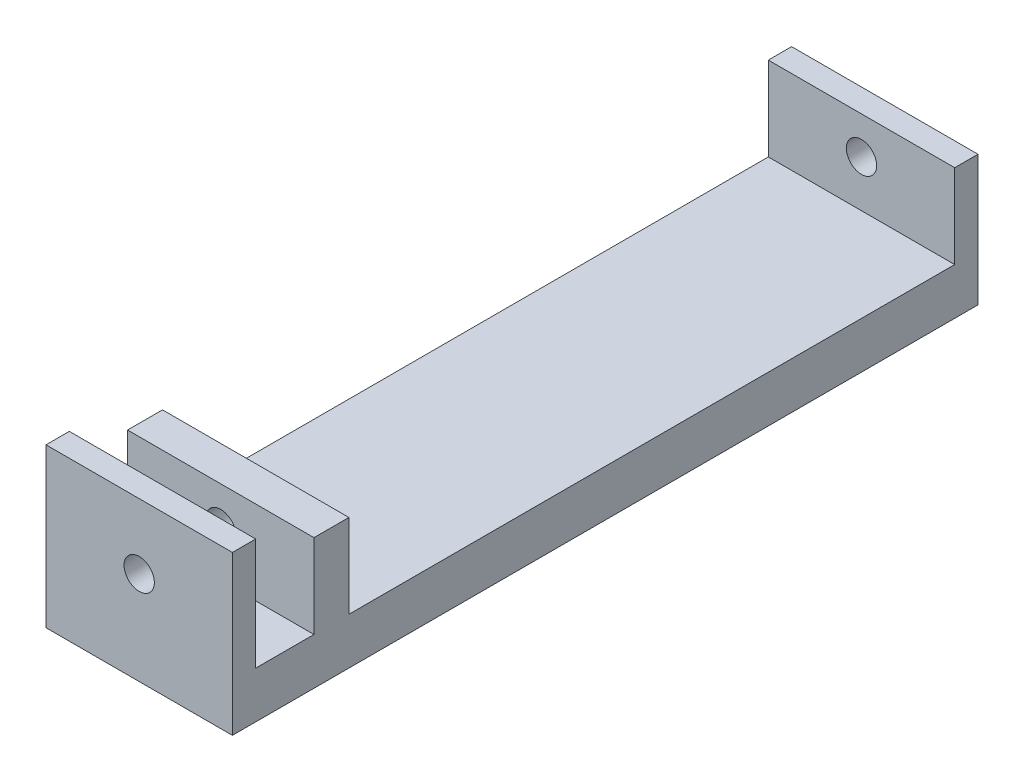
ISO-10303-21;
HEADER;
FILE_DESCRIPTION(('STEP AP214'),'2;1');
FILE_NAME('part.step','',(''),(''),'','','');
FILE_SCHEMA(('AUTOMOTIVE_DESIGN { 1 0 10303 214 1 1 1 1 }'));
ENDSEC;
DATA;
#1=APPLICATION_CONTEXT('core data for automotive mechanical design processes');
#2=APPLICATION_PROTOCOL_DEFINITION('international standard','automotive_design',2000,#1);
#3=PRODUCT_CONTEXT('',#1,'mechanical');
#4=PRODUCT('Part','Part','',(#3));
#5=PRODUCT_RELATED_PRODUCT_CATEGORY('part','',(#4));
#6=PRODUCT_DEFINITION_FORMATION('','',#4);
#7=PRODUCT_DEFINITION_CONTEXT('part definition',#1,'design');
#8=PRODUCT_DEFINITION('design','',#6,#7);
#9=PRODUCT_DEFINITION_SHAPE('','',#8);
#10=(LENGTH_UNIT() NAMED_UNIT(*) SI_UNIT(.MILLI.,.METRE.));
#11=(NAMED_UNIT(*) PLANE_ANGLE_UNIT() SI_UNIT($,.RADIAN.));
#12=(NAMED_UNIT(*) SI_UNIT($,.STERADIAN.) SOLID_ANGLE_UNIT());
#13=UNCERTAINTY_MEASURE_WITH_UNIT(LENGTH_MEASURE(1.E-05),#10,'distance_accuracy_value','');
#14=(GEOMETRIC_REPRESENTATION_CONTEXT(3) GLOBAL_UNCERTAINTY_ASSIGNED_CONTEXT((#13)) GLOBAL_UNIT_ASSIGNED_CONTEXT((#10,
#11,#12)) REPRESENTATION_CONTEXT('',''));
#15=CARTESIAN_POINT('',(0.,0.,0.));
#16=DIRECTION('',(0.,0.,1.));
#17=DIRECTION('',(1.,0.,0.));
#18=AXIS2_PLACEMENT_3D('',#15,#16,#17);
#19=CARTESIAN_POINT('',(80.,0.,-35.));
#20=DIRECTION('',(0.,0.,1.));
#21=DIRECTION('',(1.,0.,0.));
#22=AXIS2_PLACEMENT_3D('',#19,#20,#21);
#23=PLANE('',#22);
#24=CARTESIAN_POINT('',(40.,40.,-35.));
#25=DIRECTION('',(0.,0.,1.));
#26=DIRECTION('',(1.,0.,0.));
#27=AXIS2_PLACEMENT_3D('',#24,#25,#26);
#28=CIRCLE('',#27,6.5);
#29=CARTESIAN_POINT('',(46.5,40.,-35.));
#30=VERTEX_POINT('',#29);
#31=EDGE_CURVE('E184',#30,#30,#28,.T.);
#32=ORIENTED_EDGE('',*,*,#31,.F.);
#33=EDGE_LOOP('',(#32));
#34=FACE_BOUND('',#33,.T.);
#35=DIRECTION('',(0.,1.,0.));
#36=VECTOR('',#35,1.);
#37=CARTESIAN_POINT('',(0.,0.,-35.));
#38=LINE('',#37,#36);
#39=CARTESIAN_POINT('',(0.,20.,-35.));
#40=VERTEX_POINT('',#39);
#41=CARTESIAN_POINT('',(0.,56.,-35.));
#42=VERTEX_POINT('',#41);
#43=EDGE_CURVE('E188',#40,#42,#38,.T.);
#44=ORIENTED_EDGE('',*,*,#43,.F.);
#45=DIRECTION('',(-1.,0.,0.));
#46=VECTOR('',#45,1.);
#47=CARTESIAN_POINT('',(80.,20.,-35.));
#48=LINE('',#47,#46);
#49=CARTESIAN_POINT('',(80.,20.,-35.));
#50=VERTEX_POINT('',#49);
#51=EDGE_CURVE('E11',#50,#40,#48,.T.);
#52=ORIENTED_EDGE('',*,*,#51,.F.);
#53=DIRECTION('',(0.,1.,0.));
#54=VECTOR('',#53,1.);
#55=CARTESIAN_POINT('',(80.,0.,-35.));
#56=LINE('',#55,#54);
#57=CARTESIAN_POINT('',(80.,56.,-35.));
#58=VERTEX_POINT('',#57);
#59=EDGE_CURVE('E171',#50,#58,#56,.T.);
#60=ORIENTED_EDGE('',*,*,#59,.T.);
#61=DIRECTION('',(-1.,0.,0.));
#62=VECTOR('',#61,1.);
#63=CARTESIAN_POINT('',(80.,56.,-35.));
#64=LINE('',#63,#62);
#65=EDGE_CURVE('E62',#58,#42,#64,.T.);
#66=ORIENTED_EDGE('',*,*,#65,.T.);
#67=EDGE_LOOP('',(#44,#52,#60,#66));
#68=FACE_BOUND('',#67,.T.);
#69=ADVANCED_FACE('F44',(#34,#68),#23,.T.);
#70=CARTESIAN_POINT('',(80.,20.,0.));
#71=DIRECTION('',(0.,1.,0.));
#72=DIRECTION('',(0.,0.,1.));
#73=AXIS2_PLACEMENT_3D('',#70,#71,#72);
#74=PLANE('',#73);
#75=DIRECTION('',(0.,0.,-1.));
#76=VECTOR('',#75,1.);
#77=CARTESIAN_POINT('',(0.,20.,0.));
#78=LINE('',#77,#76);
#79=CARTESIAN_POINT('',(0.,20.,-10.));
#80=VERTEX_POINT('',#79);
#81=EDGE_CURVE('E239',#80,#40,#78,.T.);
#82=ORIENTED_EDGE('',*,*,#81,.F.);
#83=DIRECTION('',(-1.,0.,0.));
#84=VECTOR('',#83,1.);
#85=CARTESIAN_POINT('',(80.,20.,-10.));
#86=LINE('',#85,#84);
#87=CARTESIAN_POINT('',(80.,20.,-10.));
#88=VERTEX_POINT('',#87);
#89=EDGE_CURVE('E54',#88,#80,#86,.T.);
#90=ORIENTED_EDGE('',*,*,#89,.F.);
#91=DIRECTION('',(0.,0.,-1.));
#92=VECTOR('',#91,1.);
#93=CARTESIAN_POINT('',(80.,20.,0.));
#94=LINE('',#93,#92);
#95=EDGE_CURVE('E162',#88,#50,#94,.T.);
#96=ORIENTED_EDGE('',*,*,#95,.T.);
#97=ORIENTED_EDGE('',*,*,#51,.T.);
#98=EDGE_LOOP('',(#82,#90,#96,#97));
#99=FACE_BOUND('',#98,.T.);
#100=ADVANCED_FACE('F229',(#99),#74,.T.);
#101=CARTESIAN_POINT('',(80.,0.,-10.));
#102=DIRECTION('',(0.,0.,-1.));
#103=DIRECTION('',(0.,1.,0.));
#104=AXIS2_PLACEMENT_3D('',#101,#102,#103);
#105=PLANE('',#104);
#106=CARTESIAN_POINT('',(40.,40.,-10.));
#107=DIRECTION('',(0.,0.,-1.));
#108=DIRECTION('',(0.,1.,0.));
#109=AXIS2_PLACEMENT_3D('',#106,#107,#108);
#110=CIRCLE('',#109,6.5);
#111=CARTESIAN_POINT('',(40.,46.5,-10.));
#112=VERTEX_POINT('',#111);
#113=EDGE_CURVE('E189',#112,#112,#110,.T.);
#114=ORIENTED_EDGE('',*,*,#113,.F.);
#115=EDGE_LOOP('',(#114));
#116=FACE_BOUND('',#115,.T.);
#117=DIRECTION('',(0.,-1.,0.));
#118=VECTOR('',#117,1.);
#119=CARTESIAN_POINT('',(0.,0.,-10.));
#120=LINE('',#119,#118);
#121=CARTESIAN_POINT('',(0.,68.,-10.));
#122=VERTEX_POINT('',#121);
#123=EDGE_CURVE('E245',#122,#80,#120,.T.);
#124=ORIENTED_EDGE('',*,*,#123,.F.);
#125=DIRECTION('',(-1.,0.,0.));
#126=VECTOR('',#125,1.);
#127=CARTESIAN_POINT('',(80.,68.,-10.));
#128=LINE('',#127,#126);
#129=CARTESIAN_POINT('',(80.,68.,-10.));
#130=VERTEX_POINT('',#129);
#131=EDGE_CURVE('E290',#130,#122,#128,.T.);
#132=ORIENTED_EDGE('',*,*,#131,.F.);
#133=DIRECTION('',(0.,-1.,0.));
#134=VECTOR('',#133,1.);
#135=CARTESIAN_POINT('',(80.,0.,-10.));
#136=LINE('',#135,#134);
#137=EDGE_CURVE('E170',#130,#88,#136,.T.);
#138=ORIENTED_EDGE('',*,*,#137,.T.);
#139=ORIENTED_EDGE('',*,*,#89,.T.);
#140=EDGE_LOOP('',(#124,#132,#138,#139));
#141=FACE_BOUND('',#140,.T.);
#142=ADVANCED_FACE('F234',(#116,#141),#105,.T.);
#143=CARTESIAN_POINT('',(80.,68.,0.));
#144=DIRECTION('',(0.,1.,0.));
#145=DIRECTION('',(0.,0.,1.));
#146=AXIS2_PLACEMENT_3D('',#143,#144,#145);
#147=PLANE('',#146);
#148=DIRECTION('',(0.,0.,-1.));
#149=VECTOR('',#148,1.);
#150=CARTESIAN_POINT('',(0.,68.,0.));
#151=LINE('',#150,#149);
#152=CARTESIAN_POINT('',(0.,68.,0.));
#153=VERTEX_POINT('',#152);
#154=EDGE_CURVE('E249',#153,#122,#151,.T.);
#155=ORIENTED_EDGE('',*,*,#154,.F.);
#156=DIRECTION('',(-1.,0.,0.));
#157=VECTOR('',#156,1.);
#158=CARTESIAN_POINT('',(80.,68.,0.));
#159=LINE('',#158,#157);
#160=CARTESIAN_POINT('',(80.,68.,0.));
#161=VERTEX_POINT('',#160);
#162=EDGE_CURVE('E287',#161,#153,#159,.T.);
#163=ORIENTED_EDGE('',*,*,#162,.F.);
#164=DIRECTION('',(0.,0.,-1.));
#165=VECTOR('',#164,1.);
#166=CARTESIAN_POINT('',(80.,68.,0.));
#167=LINE('',#166,#165);
#168=EDGE_CURVE('E177',#161,#130,#167,.T.);
#169=ORIENTED_EDGE('',*,*,#168,.T.);
#170=ORIENTED_EDGE('',*,*,#131,.T.);
#171=EDGE_LOOP('',(#155,#163,#169,#170));
#172=FACE_BOUND('',#171,.T.);
#173=ADVANCED_FACE('F316',(#172),#147,.T.);
#174=CARTESIAN_POINT('',(80.,0.,0.));
#175=DIRECTION('',(0.,0.,1.));
#176=DIRECTION('',(1.,0.,0.));
#177=AXIS2_PLACEMENT_3D('',#174,#175,#176);
#178=PLANE('',#177);
#179=CARTESIAN_POINT('',(40.,40.,0.));
#180=DIRECTION('',(0.,0.,-1.));
#181=DIRECTION('',(-1.,0.,0.));
#182=AXIS2_PLACEMENT_3D('',#179,#180,#181);
#183=CIRCLE('',#182,6.5);
#184=CARTESIAN_POINT('',(33.5,40.,0.));
#185=VERTEX_POINT('',#184);
#186=EDGE_CURVE('E201',#185,#185,#183,.T.);
#187=ORIENTED_EDGE('',*,*,#186,.T.);
#188=EDGE_LOOP('',(#187));
#189=FACE_BOUND('',#188,.T.);
#190=DIRECTION('',(0.,1.,0.));
#191=VECTOR('',#190,1.);
#192=CARTESIAN_POINT('',(0.,0.,0.));
#193=LINE('',#192,#191);
#194=CARTESIAN_POINT('',(0.,0.,0.));
#195=VERTEX_POINT('',#194);
#196=EDGE_CURVE('E323',#195,#153,#193,.T.);
#197=ORIENTED_EDGE('',*,*,#196,.F.);
#198=DIRECTION('',(-1.,0.,0.));
#199=VECTOR('',#198,1.);
#200=CARTESIAN_POINT('',(80.,0.,0.));
#201=LINE('',#200,#199);
#202=CARTESIAN_POINT('',(80.,0.,0.));
#203=VERTEX_POINT('',#202);
#204=EDGE_CURVE('E284',#203,#195,#201,.T.);
#205=ORIENTED_EDGE('',*,*,#204,.F.);
#206=DIRECTION('',(0.,1.,0.));
#207=VECTOR('',#206,1.);
#208=CARTESIAN_POINT('',(80.,0.,0.));
#209=LINE('',#208,#207);
#210=EDGE_CURVE('E309',#203,#161,#209,.T.);
#211=ORIENTED_EDGE('',*,*,#210,.T.);
#212=ORIENTED_EDGE('',*,*,#162,.T.);
#213=EDGE_LOOP('',(#197,#205,#211,#212));
#214=FACE_BOUND('',#213,.T.);
#215=ADVANCED_FACE('F320',(#189,#214),#178,.T.);
#216=CARTESIAN_POINT('',(80.,0.,0.));
#217=DIRECTION('',(0.,1.,0.));
#218=DIRECTION('',(0.,0.,1.));
#219=AXIS2_PLACEMENT_3D('',#216,#217,#218);
#220=PLANE('',#219);
#221=DIRECTION('',(0.,0.,-1.));
#222=VECTOR('',#221,1.);
#223=CARTESIAN_POINT('',(0.,0.,0.));
#224=LINE('',#223,#222);
#225=CARTESIAN_POINT('',(0.,0.,-320.));
#226=VERTEX_POINT('',#225);
#227=EDGE_CURVE('E517',#195,#226,#224,.T.);
#228=ORIENTED_EDGE('',*,*,#227,.T.);
#229=DIRECTION('',(-1.,0.,0.));
#230=VECTOR('',#229,1.);
#231=CARTESIAN_POINT('',(80.,0.,-320.));
#232=LINE('',#231,#230);
#233=CARTESIAN_POINT('',(80.,0.,-320.));
#234=VERTEX_POINT('',#233);
#235=EDGE_CURVE('E280',#234,#226,#232,.T.);
#236=ORIENTED_EDGE('',*,*,#235,.F.);
#237=DIRECTION('',(0.,0.,-1.));
#238=VECTOR('',#237,1.);
#239=CARTESIAN_POINT('',(80.,0.,0.));
#240=LINE('',#239,#238);
#241=EDGE_CURVE('E306',#203,#234,#240,.T.);
#242=ORIENTED_EDGE('',*,*,#241,.F.);
#243=ORIENTED_EDGE('',*,*,#204,.T.);
#244=EDGE_LOOP('',(#228,#236,#242,#243));
#245=FACE_BOUND('',#244,.T.);
#246=ADVANCED_FACE('F327',(#245),#220,.F.);
#247=CARTESIAN_POINT('',(80.,0.,-320.));
#248=DIRECTION('',(0.,0.,1.));
#249=DIRECTION('',(1.,0.,0.));
#250=AXIS2_PLACEMENT_3D('',#247,#248,#249);
#251=PLANE('',#250);
#252=CARTESIAN_POINT('',(40.,40.,-320.));
#253=DIRECTION('',(0.,0.,-1.));
#254=DIRECTION('',(-1.,0.,0.));
#255=AXIS2_PLACEMENT_3D('',#252,#253,#254);
#256=CIRCLE('',#255,6.5);
#257=CARTESIAN_POINT('',(33.5,40.,-320.));
#258=VERTEX_POINT('',#257);
#259=EDGE_CURVE('E197',#258,#258,#256,.T.);
#260=ORIENTED_EDGE('',*,*,#259,.F.);
#261=EDGE_LOOP('',(#260));
#262=FACE_BOUND('',#261,.T.);
#263=DIRECTION('',(0.,1.,0.));
#264=VECTOR('',#263,1.);
#265=CARTESIAN_POINT('',(0.,0.,-320.));
#266=LINE('',#265,#264);
#267=CARTESIAN_POINT('',(0.,56.,-320.));
#268=VERTEX_POINT('',#267);
#269=EDGE_CURVE('E263',#226,#268,#266,.T.);
#270=ORIENTED_EDGE('',*,*,#269,.T.);
#271=DIRECTION('',(-1.,0.,0.));
#272=VECTOR('',#271,1.);
#273=CARTESIAN_POINT('',(80.,56.,-320.));
#274=LINE('',#273,#272);
#275=CARTESIAN_POINT('',(80.,56.,-320.));
#276=VERTEX_POINT('',#275);
#277=EDGE_CURVE('E276',#276,#268,#274,.T.);
#278=ORIENTED_EDGE('',*,*,#277,.F.);
#279=DIRECTION('',(0.,1.,0.));
#280=VECTOR('',#279,1.);
#281=CARTESIAN_POINT('',(80.,0.,-320.));
#282=LINE('',#281,#280);
#283=EDGE_CURVE('E303',#234,#276,#282,.T.);
#284=ORIENTED_EDGE('',*,*,#283,.F.);
#285=ORIENTED_EDGE('',*,*,#235,.T.);
#286=EDGE_LOOP('',(#270,#278,#284,#285));
#287=FACE_BOUND('',#286,.T.);
#288=ADVANCED_FACE('F333',(#262,#287),#251,.F.);
#289=CARTESIAN_POINT('',(80.,56.,0.));
#290=DIRECTION('',(0.,-1.,0.));
#291=DIRECTION('',(0.,0.,-1.));
#292=AXIS2_PLACEMENT_3D('',#289,#290,#291);
#293=PLANE('',#292);
#294=DIRECTION('',(0.,0.,1.));
#295=VECTOR('',#294,1.);
#296=CARTESIAN_POINT('',(0.,56.,0.));
#297=LINE('',#296,#295);
#298=CARTESIAN_POINT('',(0.,56.,-310.));
#299=VERTEX_POINT('',#298);
#300=EDGE_CURVE('E258',#268,#299,#297,.T.);
#301=ORIENTED_EDGE('',*,*,#300,.T.);
#302=DIRECTION('',(-1.,0.,0.));
#303=VECTOR('',#302,1.);
#304=CARTESIAN_POINT('',(80.,56.,-310.));
#305=LINE('',#304,#303);
#306=CARTESIAN_POINT('',(80.,56.,-310.));
#307=VERTEX_POINT('',#306);
#308=EDGE_CURVE('E273',#307,#299,#305,.T.);
#309=ORIENTED_EDGE('',*,*,#308,.F.);
#310=DIRECTION('',(0.,0.,1.));
#311=VECTOR('',#310,1.);
#312=CARTESIAN_POINT('',(80.,56.,0.));
#313=LINE('',#312,#311);
#314=EDGE_CURVE('E164',#276,#307,#313,.T.);
#315=ORIENTED_EDGE('',*,*,#314,.F.);
#316=ORIENTED_EDGE('',*,*,#277,.T.);
#317=EDGE_LOOP('',(#301,#309,#315,#316));
#318=FACE_BOUND('',#317,.T.);
#319=ADVANCED_FACE('F337',(#318),#293,.F.);
#320=CARTESIAN_POINT('',(80.,-4.78012691158053E-13,-310.));
#321=DIRECTION('',(0.,0.,-1.));
#322=DIRECTION('',(0.,1.,0.));
#323=AXIS2_PLACEMENT_3D('',#320,#321,#322);
#324=PLANE('',#323);
#325=CARTESIAN_POINT('',(40.,40.,-310.));
#326=DIRECTION('',(0.,0.,-1.));
#327=DIRECTION('',(0.,1.,0.));
#328=AXIS2_PLACEMENT_3D('',#325,#326,#327);
#329=CIRCLE('',#328,6.5);
#330=CARTESIAN_POINT('',(40.,46.5,-310.));
#331=VERTEX_POINT('',#330);
#332=EDGE_CURVE('E193',#331,#331,#329,.T.);
#333=ORIENTED_EDGE('',*,*,#332,.T.);
#334=EDGE_LOOP('',(#333));
#335=FACE_BOUND('',#334,.T.);
#336=DIRECTION('',(0.,-1.,0.));
#337=VECTOR('',#336,1.);
#338=CARTESIAN_POINT('',(0.,-4.78012691158053E-13,-310.));
#339=LINE('',#338,#337);
#340=CARTESIAN_POINT('',(0.,20.,-310.));
#341=VERTEX_POINT('',#340);
#342=EDGE_CURVE('E252',#299,#341,#339,.T.);
#343=ORIENTED_EDGE('',*,*,#342,.T.);
#344=DIRECTION('',(-1.,0.,0.));
#345=VECTOR('',#344,1.);
#346=CARTESIAN_POINT('',(80.,20.,-310.));
#347=LINE('',#346,#345);
#348=CARTESIAN_POINT('',(80.,20.,-310.));
#349=VERTEX_POINT('',#348);
#350=EDGE_CURVE('E147',#349,#341,#347,.T.);
#351=ORIENTED_EDGE('',*,*,#350,.F.);
#352=DIRECTION('',(0.,-1.,0.));
#353=VECTOR('',#352,1.);
#354=CARTESIAN_POINT('',(80.,-4.78012691158053E-13,-310.));
#355=LINE('',#354,#353);
#356=EDGE_CURVE('E158',#307,#349,#355,.T.);
#357=ORIENTED_EDGE('',*,*,#356,.F.);
#358=ORIENTED_EDGE('',*,*,#308,.T.);
#359=EDGE_LOOP('',(#343,#351,#357,#358));
#360=FACE_BOUND('',#359,.T.);
#361=ADVANCED_FACE('F338',(#335,#360),#324,.F.);
#362=CARTESIAN_POINT('',(0.,20.,-50.));
#363=VERTEX_POINT('',#362);
#364=EDGE_CURVE('E143',#363,#341,#78,.T.);
#365=ORIENTED_EDGE('',*,*,#364,.F.);
#366=DIRECTION('',(-1.,0.,0.));
#367=VECTOR('',#366,1.);
#368=CARTESIAN_POINT('',(80.,20.,-50.));
#369=LINE('',#368,#367);
#370=CARTESIAN_POINT('',(80.,20.,-50.));
#371=VERTEX_POINT('',#370);
#372=EDGE_CURVE('E137',#371,#363,#369,.T.);
#373=ORIENTED_EDGE('',*,*,#372,.F.);
#374=EDGE_CURVE('E141',#371,#349,#94,.T.);
#375=ORIENTED_EDGE('',*,*,#374,.T.);
#376=ORIENTED_EDGE('',*,*,#350,.T.);
#377=EDGE_LOOP('',(#365,#373,#375,#376));
#378=FACE_BOUND('',#377,.T.);
#379=ADVANCED_FACE('F139',(#378),#74,.T.);
#380=CARTESIAN_POINT('',(80.,0.,-50.));
#381=DIRECTION('',(0.,0.,1.));
#382=DIRECTION('',(1.,0.,0.));
#383=AXIS2_PLACEMENT_3D('',#380,#381,#382);
#384=PLANE('',#383);
#385=CARTESIAN_POINT('',(40.,40.,-50.));
#386=DIRECTION('',(0.,0.,1.));
#387=DIRECTION('',(1.,0.,0.));
#388=AXIS2_PLACEMENT_3D('',#385,#386,#387);
#389=CIRCLE('',#388,6.5);
#390=CARTESIAN_POINT('',(46.5,40.,-50.));
#391=VERTEX_POINT('',#390);
#392=EDGE_CURVE('E47',#391,#391,#389,.T.);
#393=ORIENTED_EDGE('',*,*,#392,.T.);
#394=EDGE_LOOP('',(#393));
#395=FACE_BOUND('',#394,.T.);
#396=DIRECTION('',(0.,1.,0.));
#397=VECTOR('',#396,1.);
#398=CARTESIAN_POINT('',(0.,0.,-50.));
#399=LINE('',#398,#397);
#400=CARTESIAN_POINT('',(0.,56.,-50.));
#401=VERTEX_POINT('',#400);
#402=EDGE_CURVE('E181',#363,#401,#399,.T.);
#403=ORIENTED_EDGE('',*,*,#402,.T.);
#404=DIRECTION('',(-1.,0.,0.));
#405=VECTOR('',#404,1.);
#406=CARTESIAN_POINT('',(80.,56.,-50.));
#407=LINE('',#406,#405);
#408=CARTESIAN_POINT('',(80.,56.,-50.));
#409=VERTEX_POINT('',#408);
#410=EDGE_CURVE('E100',#409,#401,#407,.T.);
#411=ORIENTED_EDGE('',*,*,#410,.F.);
#412=DIRECTION('',(0.,1.,0.));
#413=VECTOR('',#412,1.);
#414=CARTESIAN_POINT('',(80.,0.,-50.));
#415=LINE('',#414,#413);
#416=EDGE_CURVE('E149',#371,#409,#415,.T.);
#417=ORIENTED_EDGE('',*,*,#416,.F.);
#418=ORIENTED_EDGE('',*,*,#372,.T.);
#419=EDGE_LOOP('',(#403,#411,#417,#418));
#420=FACE_BOUND('',#419,.T.);
#421=ADVANCED_FACE('F150',(#395,#420),#384,.F.);
#422=CARTESIAN_POINT('',(80.,56.,0.));
#423=DIRECTION('',(0.,1.,0.));
#424=DIRECTION('',(0.,0.,1.));
#425=AXIS2_PLACEMENT_3D('',#422,#423,#424);
#426=PLANE('',#425);
#427=DIRECTION('',(0.,0.,-1.));
#428=VECTOR('',#427,1.);
#429=CARTESIAN_POINT('',(0.,56.,0.));
#430=LINE('',#429,#428);
#431=EDGE_CURVE('E178',#42,#401,#430,.T.);
#432=ORIENTED_EDGE('',*,*,#431,.F.);
#433=ORIENTED_EDGE('',*,*,#65,.F.);
#434=DIRECTION('',(0.,0.,-1.));
#435=VECTOR('',#434,1.);
#436=CARTESIAN_POINT('',(80.,56.,0.));
#437=LINE('',#436,#435);
#438=EDGE_CURVE('E154',#58,#409,#437,.T.);
#439=ORIENTED_EDGE('',*,*,#438,.T.);
#440=ORIENTED_EDGE('',*,*,#410,.T.);
#441=EDGE_LOOP('',(#432,#433,#439,#440));
#442=FACE_BOUND('',#441,.T.);
#443=ADVANCED_FACE('F401',(#442),#426,.T.);
#444=CARTESIAN_POINT('',(80.,0.,0.));
#445=DIRECTION('',(1.,0.,0.));
#446=DIRECTION('',(0.,0.,-1.));
#447=AXIS2_PLACEMENT_3D('',#444,#445,#446);
#448=PLANE('',#447);
#449=ORIENTED_EDGE('',*,*,#59,.F.);
#450=ORIENTED_EDGE('',*,*,#95,.F.);
#451=ORIENTED_EDGE('',*,*,#137,.F.);
#452=ORIENTED_EDGE('',*,*,#168,.F.);
#453=ORIENTED_EDGE('',*,*,#210,.F.);
#454=ORIENTED_EDGE('',*,*,#241,.T.);
#455=ORIENTED_EDGE('',*,*,#283,.T.);
#456=ORIENTED_EDGE('',*,*,#314,.T.);
#457=ORIENTED_EDGE('',*,*,#356,.T.);
#458=ORIENTED_EDGE('',*,*,#374,.F.);
#459=ORIENTED_EDGE('',*,*,#416,.T.);
#460=ORIENTED_EDGE('',*,*,#438,.F.);
#461=EDGE_LOOP('',(#449,#450,#451,#452,#453,#454,#455,#456,#457,#458,#459,#460));
#462=FACE_BOUND('',#461,.T.);
#463=ADVANCED_FACE('F156',(#462),#448,.T.);
#464=CARTESIAN_POINT('',(0.,0.,0.));
#465=DIRECTION('',(1.,0.,0.));
#466=DIRECTION('',(0.,0.,-1.));
#467=AXIS2_PLACEMENT_3D('',#464,#465,#466);
#468=PLANE('',#467);
#469=ORIENTED_EDGE('',*,*,#43,.T.);
#470=ORIENTED_EDGE('',*,*,#431,.T.);
#471=ORIENTED_EDGE('',*,*,#402,.F.);
#472=ORIENTED_EDGE('',*,*,#364,.T.);
#473=ORIENTED_EDGE('',*,*,#342,.F.);
#474=ORIENTED_EDGE('',*,*,#300,.F.);
#475=ORIENTED_EDGE('',*,*,#269,.F.);
#476=ORIENTED_EDGE('',*,*,#227,.F.);
#477=ORIENTED_EDGE('',*,*,#196,.T.);
#478=ORIENTED_EDGE('',*,*,#154,.T.);
#479=ORIENTED_EDGE('',*,*,#123,.T.);
#480=ORIENTED_EDGE('',*,*,#81,.T.);
#481=EDGE_LOOP('',(#469,#470,#471,#472,#473,#474,#475,#476,#477,#478,#479,#480));
#482=FACE_BOUND('',#481,.T.);
#483=ADVANCED_FACE('F214',(#482),#468,.F.);
#484=CARTESIAN_POINT('',(40.,40.,0.));
#485=DIRECTION('',(0.,0.,-1.));
#486=DIRECTION('',(-1.,0.,0.));
#487=AXIS2_PLACEMENT_3D('',#484,#485,#486);
#488=CYLINDRICAL_SURFACE('',#487,6.5);
#489=ORIENTED_EDGE('',*,*,#31,.T.);
#490=EDGE_LOOP('',(#489));
#491=FACE_BOUND('',#490,.T.);
#492=ORIENTED_EDGE('',*,*,#392,.F.);
#493=EDGE_LOOP('',(#492));
#494=FACE_BOUND('',#493,.T.);
#495=ADVANCED_FACE('F211',(#491,#494),#488,.F.);
#496=ORIENTED_EDGE('',*,*,#259,.T.);
#497=EDGE_LOOP('',(#496));
#498=FACE_BOUND('',#497,.T.);
#499=ORIENTED_EDGE('',*,*,#332,.F.);
#500=EDGE_LOOP('',(#499));
#501=FACE_BOUND('',#500,.T.);
#502=ADVANCED_FACE('F213',(#498,#501),#488,.F.);
#503=ORIENTED_EDGE('',*,*,#113,.T.);
#504=EDGE_LOOP('',(#503));
#505=FACE_BOUND('',#504,.T.);
#506=ORIENTED_EDGE('',*,*,#186,.F.);
#507=EDGE_LOOP('',(#506));
#508=FACE_BOUND('',#507,.T.);
#509=ADVANCED_FACE('F217',(#505,#508),#488,.F.);
#510=CLOSED_SHELL('',(#69,#100,#142,#173,#215,#246,#288,#319,#361,#379,#421,#443,#463,#483,#495,
#502,#509));
#511=MANIFOLD_SOLID_BREP('B2',#510);
#512=ADVANCED_BREP_SHAPE_REPRESENTATION('',(#18,#511),#14);
#513=SHAPE_DEFINITION_REPRESENTATION(#9,#512);
ENDSEC;
END-ISO-10303-21;
